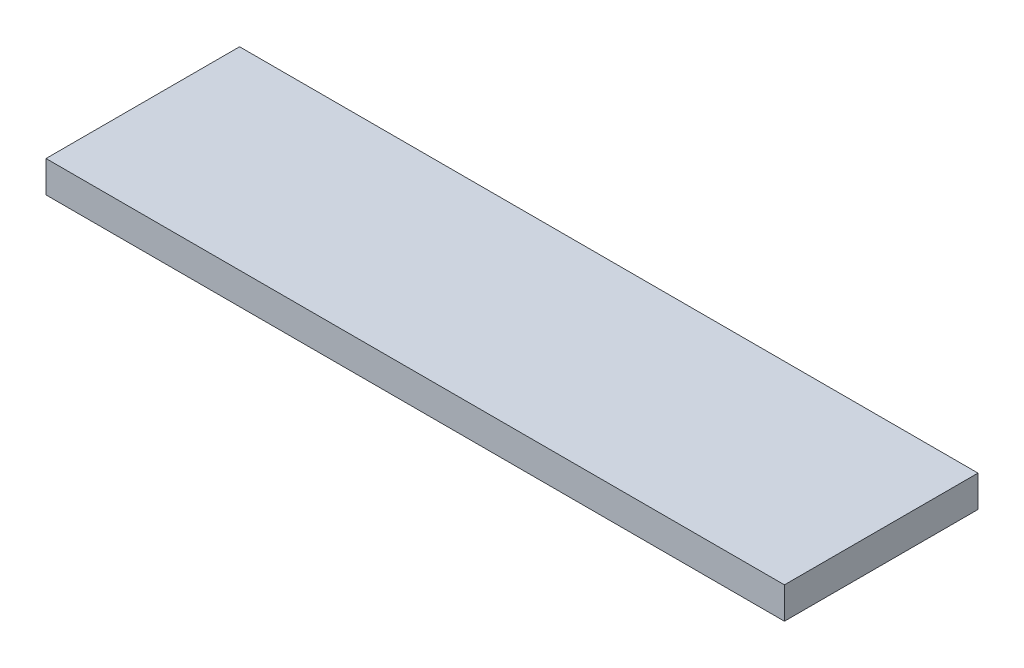
ISO-10303-21;
HEADER;
FILE_DESCRIPTION(('STEP AP214'),'2;1');
FILE_NAME('part.step','',(''),(''),'','','');
FILE_SCHEMA(('AUTOMOTIVE_DESIGN { 1 0 10303 214 1 1 1 1 }'));
ENDSEC;
DATA;
#1=APPLICATION_CONTEXT('core data for automotive mechanical design processes');
#2=APPLICATION_PROTOCOL_DEFINITION('international standard','automotive_design',2000,#1);
#3=PRODUCT_CONTEXT('',#1,'mechanical');
#4=PRODUCT('Part','Part','',(#3));
#5=PRODUCT_RELATED_PRODUCT_CATEGORY('part','',(#4));
#6=PRODUCT_DEFINITION_FORMATION('','',#4);
#7=PRODUCT_DEFINITION_CONTEXT('part definition',#1,'design');
#8=PRODUCT_DEFINITION('design','',#6,#7);
#9=PRODUCT_DEFINITION_SHAPE('','',#8);
#10=(LENGTH_UNIT() NAMED_UNIT(*) SI_UNIT(.MILLI.,.METRE.));
#11=(NAMED_UNIT(*) PLANE_ANGLE_UNIT() SI_UNIT($,.RADIAN.));
#12=(NAMED_UNIT(*) SI_UNIT($,.STERADIAN.) SOLID_ANGLE_UNIT());
#13=UNCERTAINTY_MEASURE_WITH_UNIT(LENGTH_MEASURE(1.E-05),#10,'distance_accuracy_value','');
#14=(GEOMETRIC_REPRESENTATION_CONTEXT(3) GLOBAL_UNCERTAINTY_ASSIGNED_CONTEXT((#13)) GLOBAL_UNIT_ASSIGNED_CONTEXT((#10,
#11,#12)) REPRESENTATION_CONTEXT('',''));
#15=CARTESIAN_POINT('',(0.,0.,0.));
#16=DIRECTION('',(0.,0.,1.));
#17=DIRECTION('',(1.,0.,0.));
#18=AXIS2_PLACEMENT_3D('',#15,#16,#17);
#19=CARTESIAN_POINT('',(257.5,22.,-67.5));
#20=DIRECTION('',(-1.,0.,0.));
#21=DIRECTION('',(0.,0.,1.));
#22=AXIS2_PLACEMENT_3D('',#19,#20,#21);
#23=PLANE('',#22);
#24=DIRECTION('',(0.,0.,-1.));
#25=VECTOR('',#24,1.);
#26=CARTESIAN_POINT('',(257.5,0.,-67.5));
#27=LINE('',#26,#25);
#28=CARTESIAN_POINT('',(257.5,0.,67.5));
#29=VERTEX_POINT('',#28);
#30=CARTESIAN_POINT('',(257.5,0.,-67.5));
#31=VERTEX_POINT('',#30);
#32=EDGE_CURVE('E100',#29,#31,#27,.T.);
#33=ORIENTED_EDGE('',*,*,#32,.T.);
#34=DIRECTION('',(0.,-1.,0.));
#35=VECTOR('',#34,1.);
#36=CARTESIAN_POINT('',(257.5,22.,-67.5));
#37=LINE('',#36,#35);
#38=CARTESIAN_POINT('',(257.5,22.,-67.5));
#39=VERTEX_POINT('',#38);
#40=EDGE_CURVE('E11',#39,#31,#37,.T.);
#41=ORIENTED_EDGE('',*,*,#40,.F.);
#42=DIRECTION('',(0.,0.,-1.));
#43=VECTOR('',#42,1.);
#44=CARTESIAN_POINT('',(257.5,22.,-67.5));
#45=LINE('',#44,#43);
#46=CARTESIAN_POINT('',(257.5,22.,67.5));
#47=VERTEX_POINT('',#46);
#48=EDGE_CURVE('E88',#47,#39,#45,.T.);
#49=ORIENTED_EDGE('',*,*,#48,.F.);
#50=DIRECTION('',(0.,-1.,0.));
#51=VECTOR('',#50,1.);
#52=CARTESIAN_POINT('',(257.5,22.,67.5));
#53=LINE('',#52,#51);
#54=EDGE_CURVE('E96',#47,#29,#53,.T.);
#55=ORIENTED_EDGE('',*,*,#54,.T.);
#56=EDGE_LOOP('',(#33,#41,#49,#55));
#57=FACE_BOUND('',#56,.T.);
#58=ADVANCED_FACE('F37',(#57),#23,.F.);
#59=CARTESIAN_POINT('',(-257.5,22.,-67.5));
#60=DIRECTION('',(0.,0.,1.));
#61=DIRECTION('',(1.,0.,0.));
#62=AXIS2_PLACEMENT_3D('',#59,#60,#61);
#63=PLANE('',#62);
#64=DIRECTION('',(-1.,0.,0.));
#65=VECTOR('',#64,1.);
#66=CARTESIAN_POINT('',(-257.5,0.,-67.5));
#67=LINE('',#66,#65);
#68=CARTESIAN_POINT('',(-257.5,0.,-67.5));
#69=VERTEX_POINT('',#68);
#70=EDGE_CURVE('E92',#31,#69,#67,.T.);
#71=ORIENTED_EDGE('',*,*,#70,.T.);
#72=DIRECTION('',(0.,-1.,0.));
#73=VECTOR('',#72,1.);
#74=CARTESIAN_POINT('',(-257.5,22.,-67.5));
#75=LINE('',#74,#73);
#76=CARTESIAN_POINT('',(-257.5,22.,-67.5));
#77=VERTEX_POINT('',#76);
#78=EDGE_CURVE('E45',#77,#69,#75,.T.);
#79=ORIENTED_EDGE('',*,*,#78,.F.);
#80=DIRECTION('',(-1.,0.,0.));
#81=VECTOR('',#80,1.);
#82=CARTESIAN_POINT('',(-257.5,22.,-67.5));
#83=LINE('',#82,#81);
#84=EDGE_CURVE('E83',#39,#77,#83,.T.);
#85=ORIENTED_EDGE('',*,*,#84,.F.);
#86=ORIENTED_EDGE('',*,*,#40,.T.);
#87=EDGE_LOOP('',(#71,#79,#85,#86));
#88=FACE_BOUND('',#87,.T.);
#89=ADVANCED_FACE('F91',(#88),#63,.F.);
#90=CARTESIAN_POINT('',(-257.5,22.,-67.5));
#91=DIRECTION('',(1.,0.,0.));
#92=DIRECTION('',(0.,0.,-1.));
#93=AXIS2_PLACEMENT_3D('',#90,#91,#92);
#94=PLANE('',#93);
#95=DIRECTION('',(0.,0.,1.));
#96=VECTOR('',#95,1.);
#97=CARTESIAN_POINT('',(-257.5,0.,-67.5));
#98=LINE('',#97,#96);
#99=CARTESIAN_POINT('',(-257.5,0.,67.5));
#100=VERTEX_POINT('',#99);
#101=EDGE_CURVE('E70',#69,#100,#98,.T.);
#102=ORIENTED_EDGE('',*,*,#101,.T.);
#103=DIRECTION('',(0.,-1.,0.));
#104=VECTOR('',#103,1.);
#105=CARTESIAN_POINT('',(-257.5,22.,67.5));
#106=LINE('',#105,#104);
#107=CARTESIAN_POINT('',(-257.5,22.,67.5));
#108=VERTEX_POINT('',#107);
#109=EDGE_CURVE('E93',#108,#100,#106,.T.);
#110=ORIENTED_EDGE('',*,*,#109,.F.);
#111=DIRECTION('',(0.,0.,1.));
#112=VECTOR('',#111,1.);
#113=CARTESIAN_POINT('',(-257.5,22.,-67.5));
#114=LINE('',#113,#112);
#115=EDGE_CURVE('E86',#77,#108,#114,.T.);
#116=ORIENTED_EDGE('',*,*,#115,.F.);
#117=ORIENTED_EDGE('',*,*,#78,.T.);
#118=EDGE_LOOP('',(#102,#110,#116,#117));
#119=FACE_BOUND('',#118,.T.);
#120=ADVANCED_FACE('F94',(#119),#94,.F.);
#121=CARTESIAN_POINT('',(-257.5,22.,67.5));
#122=DIRECTION('',(0.,0.,-1.));
#123=DIRECTION('',(-1.,0.,0.));
#124=AXIS2_PLACEMENT_3D('',#121,#122,#123);
#125=PLANE('',#124);
#126=DIRECTION('',(1.,0.,0.));
#127=VECTOR('',#126,1.);
#128=CARTESIAN_POINT('',(-257.5,0.,67.5));
#129=LINE('',#128,#127);
#130=EDGE_CURVE('E76',#100,#29,#129,.T.);
#131=ORIENTED_EDGE('',*,*,#130,.T.);
#132=ORIENTED_EDGE('',*,*,#54,.F.);
#133=DIRECTION('',(1.,0.,0.));
#134=VECTOR('',#133,1.);
#135=CARTESIAN_POINT('',(-257.5,22.,67.5));
#136=LINE('',#135,#134);
#137=EDGE_CURVE('E53',#108,#47,#136,.T.);
#138=ORIENTED_EDGE('',*,*,#137,.F.);
#139=ORIENTED_EDGE('',*,*,#109,.T.);
#140=EDGE_LOOP('',(#131,#132,#138,#139));
#141=FACE_BOUND('',#140,.T.);
#142=ADVANCED_FACE('F107',(#141),#125,.F.);
#143=CARTESIAN_POINT('',(0.,22.,0.));
#144=DIRECTION('',(0.,1.,0.));
#145=DIRECTION('',(0.,0.,1.));
#146=AXIS2_PLACEMENT_3D('',#143,#144,#145);
#147=PLANE('',#146);
#148=ORIENTED_EDGE('',*,*,#48,.T.);
#149=ORIENTED_EDGE('',*,*,#84,.T.);
#150=ORIENTED_EDGE('',*,*,#115,.T.);
#151=ORIENTED_EDGE('',*,*,#137,.T.);
#152=EDGE_LOOP('',(#148,#149,#150,#151));
#153=FACE_BOUND('',#152,.T.);
#154=ADVANCED_FACE('F84',(#153),#147,.T.);
#155=CARTESIAN_POINT('',(0.,0.,0.));
#156=DIRECTION('',(0.,1.,0.));
#157=DIRECTION('',(0.,0.,1.));
#158=AXIS2_PLACEMENT_3D('',#155,#156,#157);
#159=PLANE('',#158);
#160=ORIENTED_EDGE('',*,*,#32,.F.);
#161=ORIENTED_EDGE('',*,*,#130,.F.);
#162=ORIENTED_EDGE('',*,*,#101,.F.);
#163=ORIENTED_EDGE('',*,*,#70,.F.);
#164=EDGE_LOOP('',(#160,#161,#162,#163));
#165=FACE_BOUND('',#164,.T.);
#166=ADVANCED_FACE('F110',(#165),#159,.F.);
#167=CLOSED_SHELL('',(#58,#89,#120,#142,#154,#166));
#168=MANIFOLD_SOLID_BREP('B2',#167);
#169=ADVANCED_BREP_SHAPE_REPRESENTATION('',(#18,#168),#14);
#170=SHAPE_DEFINITION_REPRESENTATION(#9,#169);
ENDSEC;
END-ISO-10303-21;
